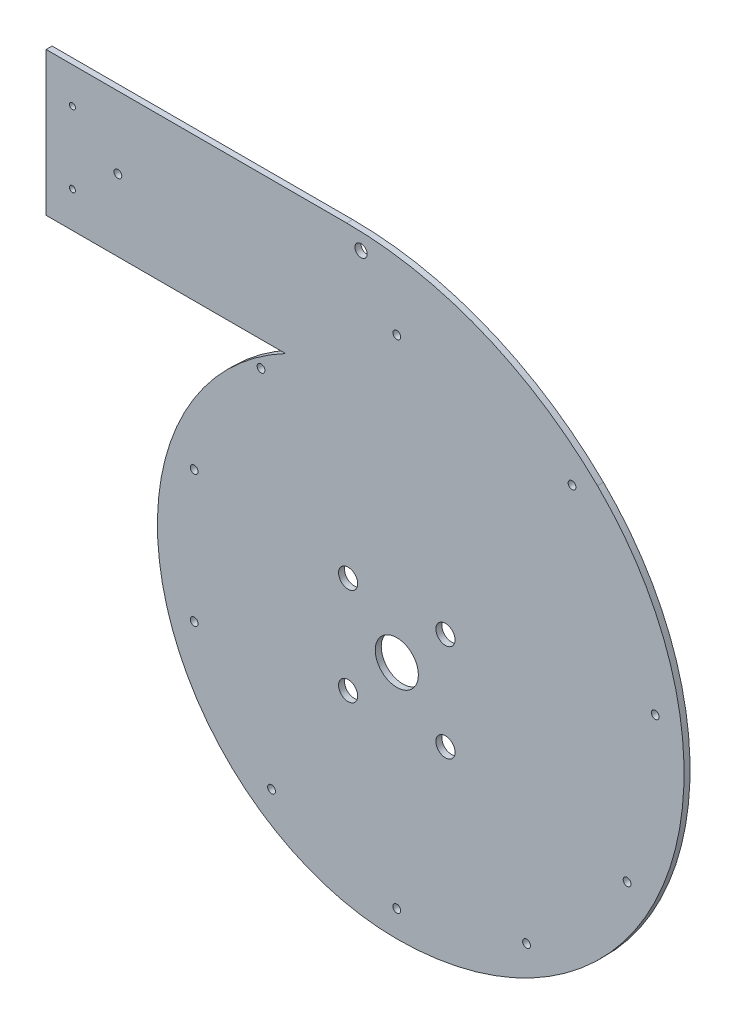
ISO-10303-21;
HEADER;
FILE_DESCRIPTION(('STEP AP214'),'2;1');
FILE_NAME('part.step','',(''),(''),'','','');
FILE_SCHEMA(('AUTOMOTIVE_DESIGN { 1 0 10303 214 1 1 1 1 }'));
ENDSEC;
DATA;
#1=APPLICATION_CONTEXT('core data for automotive mechanical design processes');
#2=APPLICATION_PROTOCOL_DEFINITION('international standard','automotive_design',2000,#1);
#3=PRODUCT_CONTEXT('',#1,'mechanical');
#4=PRODUCT('Part','Part','',(#3));
#5=PRODUCT_RELATED_PRODUCT_CATEGORY('part','',(#4));
#6=PRODUCT_DEFINITION_FORMATION('','',#4);
#7=PRODUCT_DEFINITION_CONTEXT('part definition',#1,'design');
#8=PRODUCT_DEFINITION('design','',#6,#7);
#9=PRODUCT_DEFINITION_SHAPE('','',#8);
#10=(LENGTH_UNIT() NAMED_UNIT(*) SI_UNIT(.MILLI.,.METRE.));
#11=(NAMED_UNIT(*) PLANE_ANGLE_UNIT() SI_UNIT($,.RADIAN.));
#12=(NAMED_UNIT(*) SI_UNIT($,.STERADIAN.) SOLID_ANGLE_UNIT());
#13=UNCERTAINTY_MEASURE_WITH_UNIT(LENGTH_MEASURE(1.E-05),#10,'distance_accuracy_value','');
#14=(GEOMETRIC_REPRESENTATION_CONTEXT(3) GLOBAL_UNCERTAINTY_ASSIGNED_CONTEXT((#13)) GLOBAL_UNIT_ASSIGNED_CONTEXT((#10,
#11,#12)) REPRESENTATION_CONTEXT('',''));
#15=CARTESIAN_POINT('',(0.,0.,0.));
#16=DIRECTION('',(0.,0.,1.));
#17=DIRECTION('',(1.,0.,0.));
#18=AXIS2_PLACEMENT_3D('',#15,#16,#17);
#19=CARTESIAN_POINT('',(-93.006306293609,177.058823529412,-5.));
#20=DIRECTION('',(0.,-1.,0.));
#21=DIRECTION('',(0.,0.,-1.));
#22=AXIS2_PLACEMENT_3D('',#19,#20,#21);
#23=PLANE('',#22);
#24=DIRECTION('',(1.,0.,0.));
#25=VECTOR('',#24,1.);
#26=CARTESIAN_POINT('',(-93.006306293609,177.058823529412,0.));
#27=LINE('',#26,#25);
#28=CARTESIAN_POINT('',(-293.006306293609,177.058823529412,0.));
#29=VERTEX_POINT('',#28);
#30=CARTESIAN_POINT('',(-93.006306293609,177.058823529412,0.));
#31=VERTEX_POINT('',#30);
#32=EDGE_CURVE('E130',#29,#31,#27,.T.);
#33=ORIENTED_EDGE('',*,*,#32,.F.);
#34=DIRECTION('',(0.,0.,1.));
#35=VECTOR('',#34,1.);
#36=CARTESIAN_POINT('',(-293.006306293609,177.058823529412,-5.));
#37=LINE('',#36,#35);
#38=CARTESIAN_POINT('',(-293.006306293609,177.058823529412,-5.));
#39=VERTEX_POINT('',#38);
#40=EDGE_CURVE('E46',#39,#29,#37,.T.);
#41=ORIENTED_EDGE('',*,*,#40,.F.);
#42=DIRECTION('',(1.,0.,0.));
#43=VECTOR('',#42,1.);
#44=CARTESIAN_POINT('',(-93.006306293609,177.058823529412,-5.));
#45=LINE('',#44,#43);
#46=CARTESIAN_POINT('',(-93.006306293609,177.058823529412,-5.));
#47=VERTEX_POINT('',#46);
#48=EDGE_CURVE('E109',#39,#47,#45,.T.);
#49=ORIENTED_EDGE('',*,*,#48,.T.);
#50=DIRECTION('',(0.,0.,1.));
#51=VECTOR('',#50,1.);
#52=CARTESIAN_POINT('',(-93.006306293609,177.058823529412,-5.));
#53=LINE('',#52,#51);
#54=EDGE_CURVE('E11',#47,#31,#53,.T.);
#55=ORIENTED_EDGE('',*,*,#54,.T.);
#56=EDGE_LOOP('',(#33,#41,#49,#55));
#57=FACE_BOUND('',#56,.T.);
#58=ADVANCED_FACE('F36',(#57),#23,.T.);
#59=CARTESIAN_POINT('',(-293.006306293609,297.058823529412,-5.));
#60=DIRECTION('',(-1.,0.,0.));
#61=DIRECTION('',(0.,0.,1.));
#62=AXIS2_PLACEMENT_3D('',#59,#60,#61);
#63=PLANE('',#62);
#64=DIRECTION('',(0.,-1.,0.));
#65=VECTOR('',#64,1.);
#66=CARTESIAN_POINT('',(-293.006306293609,297.058823529412,0.));
#67=LINE('',#66,#65);
#68=CARTESIAN_POINT('',(-293.006306293609,297.058823529412,0.));
#69=VERTEX_POINT('',#68);
#70=EDGE_CURVE('E95',#69,#29,#67,.T.);
#71=ORIENTED_EDGE('',*,*,#70,.F.);
#72=DIRECTION('',(0.,0.,1.));
#73=VECTOR('',#72,1.);
#74=CARTESIAN_POINT('',(-293.006306293609,297.058823529412,-5.));
#75=LINE('',#74,#73);
#76=CARTESIAN_POINT('',(-293.006306293609,297.058823529412,-5.));
#77=VERTEX_POINT('',#76);
#78=EDGE_CURVE('E90',#77,#69,#75,.T.);
#79=ORIENTED_EDGE('',*,*,#78,.F.);
#80=DIRECTION('',(0.,-1.,0.));
#81=VECTOR('',#80,1.);
#82=CARTESIAN_POINT('',(-293.006306293609,297.058823529412,-5.));
#83=LINE('',#82,#81);
#84=EDGE_CURVE('E93',#77,#39,#83,.T.);
#85=ORIENTED_EDGE('',*,*,#84,.T.);
#86=ORIENTED_EDGE('',*,*,#40,.T.);
#87=EDGE_LOOP('',(#71,#79,#85,#86));
#88=FACE_BOUND('',#87,.T.);
#89=ADVANCED_FACE('F92',(#88),#63,.T.);
#90=CARTESIAN_POINT('',(-41.905314261103,297.058823529412,-5.));
#91=DIRECTION('',(0.,1.,0.));
#92=DIRECTION('',(0.,0.,1.));
#93=AXIS2_PLACEMENT_3D('',#90,#91,#92);
#94=PLANE('',#93);
#95=DIRECTION('',(-1.,0.,0.));
#96=VECTOR('',#95,1.);
#97=CARTESIAN_POINT('',(-41.905314261103,297.058823529412,0.));
#98=LINE('',#97,#96);
#99=CARTESIAN_POINT('',(-41.905314261103,297.058823529412,0.));
#100=VERTEX_POINT('',#99);
#101=EDGE_CURVE('E127',#100,#69,#98,.T.);
#102=ORIENTED_EDGE('',*,*,#101,.F.);
#103=DIRECTION('',(0.,0.,1.));
#104=VECTOR('',#103,1.);
#105=CARTESIAN_POINT('',(-41.905314261103,297.058823529412,-5.));
#106=LINE('',#105,#104);
#107=CARTESIAN_POINT('',(-41.905314261103,297.058823529412,-5.));
#108=VERTEX_POINT('',#107);
#109=EDGE_CURVE('E100',#108,#100,#106,.T.);
#110=ORIENTED_EDGE('',*,*,#109,.F.);
#111=DIRECTION('',(-1.,0.,0.));
#112=VECTOR('',#111,1.);
#113=CARTESIAN_POINT('',(-41.905314261103,297.058823529412,-5.));
#114=LINE('',#113,#112);
#115=EDGE_CURVE('E106',#108,#77,#114,.T.);
#116=ORIENTED_EDGE('',*,*,#115,.T.);
#117=ORIENTED_EDGE('',*,*,#78,.T.);
#118=EDGE_LOOP('',(#102,#110,#116,#117));
#119=FACE_BOUND('',#118,.T.);
#120=ADVANCED_FACE('F111',(#119),#94,.T.);
#121=CARTESIAN_POINT('',(-41.905314261103,-2.94117647058825,-5.));
#122=DIRECTION('',(0.,0.,1.));
#123=DIRECTION('',(1.,0.,0.));
#124=AXIS2_PLACEMENT_3D('',#121,#122,#123);
#125=CYLINDRICAL_SURFACE('',#124,300.);
#126=CARTESIAN_POINT('',(-41.905314261103,-2.94117647058825,0.));
#127=DIRECTION('',(0.,0.,1.));
#128=DIRECTION('',(1.,0.,0.));
#129=AXIS2_PLACEMENT_3D('',#126,#127,#128);
#130=CIRCLE('',#129,300.);
#131=CARTESIAN_POINT('',(167.621257044412,211.764705882353,0.));
#132=VERTEX_POINT('',#131);
#133=EDGE_CURVE('E124',#132,#100,#130,.T.);
#134=ORIENTED_EDGE('',*,*,#133,.F.);
#135=DIRECTION('',(0.,0.,1.));
#136=VECTOR('',#135,1.);
#137=CARTESIAN_POINT('',(167.621257044412,211.764705882353,-5.));
#138=LINE('',#137,#136);
#139=CARTESIAN_POINT('',(167.621257044412,211.764705882353,-5.));
#140=VERTEX_POINT('',#139);
#141=EDGE_CURVE('E134',#140,#132,#138,.T.);
#142=ORIENTED_EDGE('',*,*,#141,.F.);
#143=CARTESIAN_POINT('',(-41.905314261103,-2.94117647058825,-5.));
#144=DIRECTION('',(0.,0.,1.));
#145=DIRECTION('',(1.,0.,0.));
#146=AXIS2_PLACEMENT_3D('',#143,#144,#145);
#147=CIRCLE('',#146,300.);
#148=EDGE_CURVE('E112',#140,#108,#147,.T.);
#149=ORIENTED_EDGE('',*,*,#148,.T.);
#150=ORIENTED_EDGE('',*,*,#109,.T.);
#151=EDGE_LOOP('',(#134,#142,#149,#150));
#152=FACE_BOUND('',#151,.T.);
#153=ADVANCED_FACE('F156',(#152),#125,.T.);
#154=CARTESIAN_POINT('',(0.,40.,-5.));
#155=DIRECTION('',(0.,0.,1.));
#156=DIRECTION('',(1.,0.,0.));
#157=AXIS2_PLACEMENT_3D('',#154,#155,#156);
#158=CYLINDRICAL_SURFACE('',#157,240.);
#159=CARTESIAN_POINT('',(0.,40.,0.));
#160=DIRECTION('',(0.,0.,1.));
#161=DIRECTION('',(1.,0.,0.));
#162=AXIS2_PLACEMENT_3D('',#159,#160,#161);
#163=CIRCLE('',#162,240.);
#164=CARTESIAN_POINT('',(0.,-200.,0.));
#165=VERTEX_POINT('',#164);
#166=EDGE_CURVE('E120',#165,#132,#163,.T.);
#167=ORIENTED_EDGE('',*,*,#166,.F.);
#168=DIRECTION('',(0.,0.,1.));
#169=VECTOR('',#168,1.);
#170=CARTESIAN_POINT('',(0.,-200.,-5.));
#171=LINE('',#170,#169);
#172=CARTESIAN_POINT('',(0.,-200.,-5.));
#173=VERTEX_POINT('',#172);
#174=EDGE_CURVE('E40',#173,#165,#171,.T.);
#175=ORIENTED_EDGE('',*,*,#174,.F.);
#176=CARTESIAN_POINT('',(0.,40.,-5.));
#177=DIRECTION('',(0.,0.,1.));
#178=DIRECTION('',(1.,0.,0.));
#179=AXIS2_PLACEMENT_3D('',#176,#177,#178);
#180=CIRCLE('',#179,240.);
#181=EDGE_CURVE('E114',#173,#140,#180,.T.);
#182=ORIENTED_EDGE('',*,*,#181,.T.);
#183=ORIENTED_EDGE('',*,*,#141,.T.);
#184=EDGE_LOOP('',(#167,#175,#182,#183));
#185=FACE_BOUND('',#184,.T.);
#186=ADVANCED_FACE('F140',(#185),#158,.T.);
#187=CARTESIAN_POINT('',(0.,0.,-5.));
#188=DIRECTION('',(0.,0.,1.));
#189=DIRECTION('',(1.,0.,0.));
#190=AXIS2_PLACEMENT_3D('',#187,#188,#189);
#191=CYLINDRICAL_SURFACE('',#190,200.);
#192=CARTESIAN_POINT('',(0.,0.,0.));
#193=DIRECTION('',(0.,0.,1.));
#194=DIRECTION('',(1.,0.,0.));
#195=AXIS2_PLACEMENT_3D('',#192,#193,#194);
#196=CIRCLE('',#195,200.);
#197=EDGE_CURVE('E79',#31,#165,#196,.T.);
#198=ORIENTED_EDGE('',*,*,#197,.F.);
#199=ORIENTED_EDGE('',*,*,#54,.F.);
#200=CARTESIAN_POINT('',(0.,0.,-5.));
#201=DIRECTION('',(0.,0.,1.));
#202=DIRECTION('',(-1.,0.,0.));
#203=AXIS2_PLACEMENT_3D('',#200,#201,#202);
#204=CIRCLE('',#203,200.);
#205=EDGE_CURVE('E82',#47,#173,#204,.T.);
#206=ORIENTED_EDGE('',*,*,#205,.T.);
#207=ORIENTED_EDGE('',*,*,#174,.T.);
#208=EDGE_LOOP('',(#198,#199,#206,#207));
#209=FACE_BOUND('',#208,.T.);
#210=ADVANCED_FACE('F38',(#209),#191,.T.);
#211=CARTESIAN_POINT('',(0.,0.,-5.));
#212=DIRECTION('',(0.,0.,-1.));
#213=DIRECTION('',(-1.,0.,0.));
#214=AXIS2_PLACEMENT_3D('',#211,#212,#213);
#215=PLANE('',#214);
#216=CARTESIAN_POINT('',(-271.006306293609,207.058823529412,-5.));
#217=DIRECTION('',(0.,0.,1.));
#218=DIRECTION('',(1.,0.,0.));
#219=AXIS2_PLACEMENT_3D('',#216,#217,#218);
#220=CIRCLE('',#219,2.50000000000002);
#221=CARTESIAN_POINT('',(-268.506306293609,207.058823529412,-5.));
#222=VERTEX_POINT('',#221);
#223=EDGE_CURVE('E253',#222,#222,#220,.T.);
#224=ORIENTED_EDGE('',*,*,#223,.T.);
#225=EDGE_LOOP('',(#224));
#226=FACE_BOUND('',#225,.T.);
#227=CARTESIAN_POINT('',(-271.006306293609,267.058823529412,-5.));
#228=DIRECTION('',(0.,0.,1.));
#229=DIRECTION('',(-1.,0.,0.));
#230=AXIS2_PLACEMENT_3D('',#227,#228,#229);
#231=CIRCLE('',#230,2.50000000000002);
#232=CARTESIAN_POINT('',(-273.506306293609,267.058823529412,-5.));
#233=VERTEX_POINT('',#232);
#234=EDGE_CURVE('E257',#233,#233,#231,.T.);
#235=ORIENTED_EDGE('',*,*,#234,.T.);
#236=EDGE_LOOP('',(#235));
#237=FACE_BOUND('',#236,.T.);
#238=CARTESIAN_POINT('',(192.393369960535,-62.5123953248023,-5.));
#239=DIRECTION('',(0.,0.,-1.));
#240=DIRECTION('',(-1.,0.,0.));
#241=AXIS2_PLACEMENT_3D('',#238,#239,#240);
#242=CIRCLE('',#241,3.25);
#243=CARTESIAN_POINT('',(189.143369960535,-62.5123953248023,-5.));
#244=VERTEX_POINT('',#243);
#245=EDGE_CURVE('E329',#244,#244,#242,.T.);
#246=ORIENTED_EDGE('',*,*,#245,.F.);
#247=EDGE_LOOP('',(#246));
#248=FACE_BOUND('',#247,.T.);
#249=CARTESIAN_POINT('',(215.904780052234,70.1517155498044,-5.));
#250=DIRECTION('',(0.,0.,-1.));
#251=DIRECTION('',(-1.,0.,0.));
#252=AXIS2_PLACEMENT_3D('',#249,#250,#251);
#253=CIRCLE('',#252,3.25000000000001);
#254=CARTESIAN_POINT('',(212.654780052234,70.1517155498044,-5.));
#255=VERTEX_POINT('',#254);
#256=EDGE_CURVE('E326',#255,#255,#253,.T.);
#257=ORIENTED_EDGE('',*,*,#256,.F.);
#258=EDGE_LOOP('',(#257));
#259=FACE_BOUND('',#258,.T.);
#260=CARTESIAN_POINT('',(146.429769795033,201.543287764639,-5.));
#261=DIRECTION('',(0.,0.,-1.));
#262=DIRECTION('',(-1.,0.,0.));
#263=AXIS2_PLACEMENT_3D('',#260,#261,#262);
#264=CIRCLE('',#263,3.25000000000001);
#265=CARTESIAN_POINT('',(143.179769795033,201.543287764639,-5.));
#266=VERTEX_POINT('',#265);
#267=EDGE_CURVE('E323',#266,#266,#264,.T.);
#268=ORIENTED_EDGE('',*,*,#267,.F.);
#269=EDGE_LOOP('',(#268));
#270=FACE_BOUND('',#269,.T.);
#271=CARTESIAN_POINT('',(-233.006306293609,237.058823529412,-5.));
#272=DIRECTION('',(0.,0.,-1.));
#273=DIRECTION('',(-1.,0.,0.));
#274=AXIS2_PLACEMENT_3D('',#271,#272,#273);
#275=CIRCLE('',#274,3.25000000000001);
#276=CARTESIAN_POINT('',(-236.256306293609,237.058823529412,-5.));
#277=VERTEX_POINT('',#276);
#278=EDGE_CURVE('E320',#277,#277,#275,.T.);
#279=ORIENTED_EDGE('',*,*,#278,.F.);
#280=EDGE_LOOP('',(#279));
#281=FACE_BOUND('',#280,.T.);
#282=CARTESIAN_POINT('',(0.,237.058823529412,-5.));
#283=DIRECTION('',(0.,0.,-1.));
#284=DIRECTION('',(-1.,0.,0.));
#285=AXIS2_PLACEMENT_3D('',#282,#283,#284);
#286=CIRCLE('',#285,3.25);
#287=CARTESIAN_POINT('',(-3.25,237.058823529412,-5.));
#288=VERTEX_POINT('',#287);
#289=EDGE_CURVE('E317',#288,#288,#286,.T.);
#290=ORIENTED_EDGE('',*,*,#289,.F.);
#291=EDGE_LOOP('',(#290));
#292=FACE_BOUND('',#291,.T.);
#293=CARTESIAN_POINT('',(-169.288059900537,55.0050249987407,-5.));
#294=DIRECTION('',(0.,0.,-1.));
#295=DIRECTION('',(-1.,0.,0.));
#296=AXIS2_PLACEMENT_3D('',#293,#294,#295);
#297=CIRCLE('',#296,3.24999999999998);
#298=CARTESIAN_POINT('',(-172.538059900537,55.0050249987407,-5.));
#299=VERTEX_POINT('',#298);
#300=EDGE_CURVE('E314',#299,#299,#297,.T.);
#301=ORIENTED_EDGE('',*,*,#300,.F.);
#302=EDGE_LOOP('',(#301));
#303=FACE_BOUND('',#302,.T.);
#304=CARTESIAN_POINT('',(0.,-178.,-5.));
#305=DIRECTION('',(0.,0.,-1.));
#306=DIRECTION('',(-1.,0.,0.));
#307=AXIS2_PLACEMENT_3D('',#304,#305,#306);
#308=CIRCLE('',#307,3.25);
#309=CARTESIAN_POINT('',(-3.25000000000005,-178.,-5.));
#310=VERTEX_POINT('',#309);
#311=EDGE_CURVE('E311',#310,#310,#308,.T.);
#312=ORIENTED_EDGE('',*,*,#311,.F.);
#313=EDGE_LOOP('',(#312));
#314=FACE_BOUND('',#313,.T.);
#315=CARTESIAN_POINT('',(-104.62577490806,-144.005024998741,-5.));
#316=DIRECTION('',(0.,0.,-1.));
#317=DIRECTION('',(-1.,0.,0.));
#318=AXIS2_PLACEMENT_3D('',#315,#316,#317);
#319=CIRCLE('',#318,3.25000000000008);
#320=CARTESIAN_POINT('',(-107.87577490806,-144.005024998741,-5.));
#321=VERTEX_POINT('',#320);
#322=EDGE_CURVE('E308',#321,#321,#319,.T.);
#323=ORIENTED_EDGE('',*,*,#322,.F.);
#324=EDGE_LOOP('',(#323));
#325=FACE_BOUND('',#324,.T.);
#326=CARTESIAN_POINT('',(108.368646242067,-149.156645433518,-5.));
#327=DIRECTION('',(0.,0.,-1.));
#328=DIRECTION('',(-1.,0.,0.));
#329=AXIS2_PLACEMENT_3D('',#326,#327,#328);
#330=CIRCLE('',#329,3.25000000000001);
#331=CARTESIAN_POINT('',(105.118646242067,-149.156645433518,-5.));
#332=VERTEX_POINT('',#331);
#333=EDGE_CURVE('E305',#332,#332,#330,.T.);
#334=ORIENTED_EDGE('',*,*,#333,.F.);
#335=EDGE_LOOP('',(#334));
#336=FACE_BOUND('',#335,.T.);
#337=CARTESIAN_POINT('',(-113.442553692447,156.140279914365,-5.));
#338=DIRECTION('',(0.,0.,-1.));
#339=DIRECTION('',(-1.,0.,0.));
#340=AXIS2_PLACEMENT_3D('',#337,#338,#339);
#341=CIRCLE('',#340,3.25000000000001);
#342=CARTESIAN_POINT('',(-116.692553692447,156.140279914365,-5.));
#343=VERTEX_POINT('',#342);
#344=EDGE_CURVE('E302',#343,#343,#341,.T.);
#345=ORIENTED_EDGE('',*,*,#344,.F.);
#346=EDGE_LOOP('',(#345));
#347=FACE_BOUND('',#346,.T.);
#348=CARTESIAN_POINT('',(-169.288059900537,-55.0050249987406,-5.));
#349=DIRECTION('',(0.,0.,-1.));
#350=DIRECTION('',(-1.,0.,0.));
#351=AXIS2_PLACEMENT_3D('',#348,#349,#350);
#352=CIRCLE('',#351,3.25000000000002);
#353=CARTESIAN_POINT('',(-172.538059900537,-55.0050249987406,-5.));
#354=VERTEX_POINT('',#353);
#355=EDGE_CURVE('E299',#354,#354,#352,.T.);
#356=ORIENTED_EDGE('',*,*,#355,.F.);
#357=EDGE_LOOP('',(#356));
#358=FACE_BOUND('',#357,.T.);
#359=CARTESIAN_POINT('',(-29.905314261103,283.058823529412,-5.));
#360=DIRECTION('',(0.,0.,1.));
#361=DIRECTION('',(1.,0.,0.));
#362=AXIS2_PLACEMENT_3D('',#359,#360,#361);
#363=CIRCLE('',#362,5.1);
#364=CARTESIAN_POINT('',(-24.805314261103,283.058823529412,-5.));
#365=VERTEX_POINT('',#364);
#366=EDGE_CURVE('E333',#365,#365,#363,.T.);
#367=ORIENTED_EDGE('',*,*,#366,.T.);
#368=EDGE_LOOP('',(#367));
#369=FACE_BOUND('',#368,.T.);
#370=CARTESIAN_POINT('',(40.6586399182264,40.6586399182266,-5.));
#371=DIRECTION('',(0.,0.,-1.));
#372=DIRECTION('',(-1.,0.,0.));
#373=AXIS2_PLACEMENT_3D('',#370,#371,#372);
#374=CIRCLE('',#373,8.);
#375=CARTESIAN_POINT('',(32.6586399182264,40.6586399182266,-5.));
#376=VERTEX_POINT('',#375);
#377=EDGE_CURVE('E341',#376,#376,#374,.T.);
#378=ORIENTED_EDGE('',*,*,#377,.F.);
#379=EDGE_LOOP('',(#378));
#380=FACE_BOUND('',#379,.T.);
#381=CARTESIAN_POINT('',(-40.6586399182266,40.6586399182264,-5.));
#382=DIRECTION('',(0.,0.,-1.));
#383=DIRECTION('',(-1.,0.,0.));
#384=AXIS2_PLACEMENT_3D('',#381,#382,#383);
#385=CIRCLE('',#384,8.);
#386=CARTESIAN_POINT('',(-48.6586399182266,40.6586399182264,-5.));
#387=VERTEX_POINT('',#386);
#388=EDGE_CURVE('E347',#387,#387,#385,.T.);
#389=ORIENTED_EDGE('',*,*,#388,.F.);
#390=EDGE_LOOP('',(#389));
#391=FACE_BOUND('',#390,.T.);
#392=CARTESIAN_POINT('',(-40.6586399182264,-40.6586399182266,-5.));
#393=DIRECTION('',(0.,0.,-1.));
#394=DIRECTION('',(-1.,0.,0.));
#395=AXIS2_PLACEMENT_3D('',#392,#393,#394);
#396=CIRCLE('',#395,8.);
#397=CARTESIAN_POINT('',(-48.6586399182264,-40.6586399182266,-5.));
#398=VERTEX_POINT('',#397);
#399=EDGE_CURVE('E353',#398,#398,#396,.T.);
#400=ORIENTED_EDGE('',*,*,#399,.F.);
#401=EDGE_LOOP('',(#400));
#402=FACE_BOUND('',#401,.T.);
#403=CARTESIAN_POINT('',(40.6586399182266,-40.6586399182264,-5.));
#404=DIRECTION('',(0.,0.,-1.));
#405=DIRECTION('',(-1.,0.,0.));
#406=AXIS2_PLACEMENT_3D('',#403,#404,#405);
#407=CIRCLE('',#406,8.);
#408=CARTESIAN_POINT('',(32.6586399182266,-40.6586399182264,-5.));
#409=VERTEX_POINT('',#408);
#410=EDGE_CURVE('E359',#409,#409,#407,.T.);
#411=ORIENTED_EDGE('',*,*,#410,.F.);
#412=EDGE_LOOP('',(#411));
#413=FACE_BOUND('',#412,.T.);
#414=CARTESIAN_POINT('',(0.,0.,-5.));
#415=DIRECTION('',(0.,0.,-1.));
#416=DIRECTION('',(-1.,0.,0.));
#417=AXIS2_PLACEMENT_3D('',#414,#415,#416);
#418=CIRCLE('',#417,18.);
#419=CARTESIAN_POINT('',(-18.,0.,-5.));
#420=VERTEX_POINT('',#419);
#421=EDGE_CURVE('E121',#420,#420,#418,.T.);
#422=ORIENTED_EDGE('',*,*,#421,.F.);
#423=EDGE_LOOP('',(#422));
#424=FACE_BOUND('',#423,.T.);
#425=ORIENTED_EDGE('',*,*,#205,.F.);
#426=ORIENTED_EDGE('',*,*,#48,.F.);
#427=ORIENTED_EDGE('',*,*,#84,.F.);
#428=ORIENTED_EDGE('',*,*,#115,.F.);
#429=ORIENTED_EDGE('',*,*,#148,.F.);
#430=ORIENTED_EDGE('',*,*,#181,.F.);
#431=EDGE_LOOP('',(#425,#426,#427,#428,#429,#430));
#432=FACE_BOUND('',#431,.T.);
#433=ADVANCED_FACE('F104',(#226,#237,#248,#259,#270,#281,#292,#303,#314,#325,#336,#347,#358,
#369,#380,#391,#402,#413,#424,#432),#215,.T.);
#434=CARTESIAN_POINT('',(0.,0.,0.));
#435=DIRECTION('',(0.,0.,-1.));
#436=DIRECTION('',(-1.,0.,0.));
#437=AXIS2_PLACEMENT_3D('',#434,#435,#436);
#438=PLANE('',#437);
#439=CARTESIAN_POINT('',(-271.006306293609,207.058823529412,0.));
#440=DIRECTION('',(0.,0.,1.));
#441=DIRECTION('',(1.,0.,0.));
#442=AXIS2_PLACEMENT_3D('',#439,#440,#441);
#443=CIRCLE('',#442,2.50000000000002);
#444=CARTESIAN_POINT('',(-268.506306293609,207.058823529412,0.));
#445=VERTEX_POINT('',#444);
#446=EDGE_CURVE('E256',#445,#445,#443,.T.);
#447=ORIENTED_EDGE('',*,*,#446,.F.);
#448=EDGE_LOOP('',(#447));
#449=FACE_BOUND('',#448,.T.);
#450=CARTESIAN_POINT('',(-271.006306293609,267.058823529412,0.));
#451=DIRECTION('',(0.,0.,1.));
#452=DIRECTION('',(-1.,0.,0.));
#453=AXIS2_PLACEMENT_3D('',#450,#451,#452);
#454=CIRCLE('',#453,2.50000000000002);
#455=CARTESIAN_POINT('',(-273.506306293609,267.058823529412,0.));
#456=VERTEX_POINT('',#455);
#457=EDGE_CURVE('E262',#456,#456,#454,.T.);
#458=ORIENTED_EDGE('',*,*,#457,.F.);
#459=EDGE_LOOP('',(#458));
#460=FACE_BOUND('',#459,.T.);
#461=CARTESIAN_POINT('',(192.393369960535,-62.5123953248023,0.));
#462=DIRECTION('',(0.,0.,1.));
#463=DIRECTION('',(1.,0.,0.));
#464=AXIS2_PLACEMENT_3D('',#461,#462,#463);
#465=CIRCLE('',#464,3.25);
#466=CARTESIAN_POINT('',(195.643369960535,-62.5123953248023,0.));
#467=VERTEX_POINT('',#466);
#468=EDGE_CURVE('E270',#467,#467,#465,.T.);
#469=ORIENTED_EDGE('',*,*,#468,.F.);
#470=EDGE_LOOP('',(#469));
#471=FACE_BOUND('',#470,.T.);
#472=CARTESIAN_POINT('',(215.904780052234,70.1517155498044,0.));
#473=DIRECTION('',(0.,0.,1.));
#474=DIRECTION('',(1.,0.,0.));
#475=AXIS2_PLACEMENT_3D('',#472,#473,#474);
#476=CIRCLE('',#475,3.25000000000001);
#477=CARTESIAN_POINT('',(219.154780052234,70.1517155498044,0.));
#478=VERTEX_POINT('',#477);
#479=EDGE_CURVE('E280',#478,#478,#476,.T.);
#480=ORIENTED_EDGE('',*,*,#479,.F.);
#481=EDGE_LOOP('',(#480));
#482=FACE_BOUND('',#481,.T.);
#483=CARTESIAN_POINT('',(146.429769795033,201.543287764639,0.));
#484=DIRECTION('',(0.,0.,1.));
#485=DIRECTION('',(1.,0.,0.));
#486=AXIS2_PLACEMENT_3D('',#483,#484,#485);
#487=CIRCLE('',#486,3.25000000000001);
#488=CARTESIAN_POINT('',(149.679769795033,201.543287764639,0.));
#489=VERTEX_POINT('',#488);
#490=EDGE_CURVE('E277',#489,#489,#487,.T.);
#491=ORIENTED_EDGE('',*,*,#490,.F.);
#492=EDGE_LOOP('',(#491));
#493=FACE_BOUND('',#492,.T.);
#494=CARTESIAN_POINT('',(-233.006306293609,237.058823529412,0.));
#495=DIRECTION('',(0.,0.,1.));
#496=DIRECTION('',(1.,0.,0.));
#497=AXIS2_PLACEMENT_3D('',#494,#495,#496);
#498=CIRCLE('',#497,3.25000000000001);
#499=CARTESIAN_POINT('',(-229.756306293609,237.058823529412,0.));
#500=VERTEX_POINT('',#499);
#501=EDGE_CURVE('E273',#500,#500,#498,.T.);
#502=ORIENTED_EDGE('',*,*,#501,.F.);
#503=EDGE_LOOP('',(#502));
#504=FACE_BOUND('',#503,.T.);
#505=CARTESIAN_POINT('',(0.,237.058823529412,0.));
#506=DIRECTION('',(0.,0.,1.));
#507=DIRECTION('',(1.,0.,0.));
#508=AXIS2_PLACEMENT_3D('',#505,#506,#507);
#509=CIRCLE('',#508,3.25);
#510=CARTESIAN_POINT('',(3.25,237.058823529412,0.));
#511=VERTEX_POINT('',#510);
#512=EDGE_CURVE('E276',#511,#511,#509,.T.);
#513=ORIENTED_EDGE('',*,*,#512,.F.);
#514=EDGE_LOOP('',(#513));
#515=FACE_BOUND('',#514,.T.);
#516=CARTESIAN_POINT('',(-169.288059900537,55.0050249987407,0.));
#517=DIRECTION('',(0.,0.,1.));
#518=DIRECTION('',(1.,0.,0.));
#519=AXIS2_PLACEMENT_3D('',#516,#517,#518);
#520=CIRCLE('',#519,3.24999999999998);
#521=CARTESIAN_POINT('',(-166.038059900537,55.0050249987407,0.));
#522=VERTEX_POINT('',#521);
#523=EDGE_CURVE('E292',#522,#522,#520,.T.);
#524=ORIENTED_EDGE('',*,*,#523,.F.);
#525=EDGE_LOOP('',(#524));
#526=FACE_BOUND('',#525,.T.);
#527=CARTESIAN_POINT('',(0.,-178.,0.));
#528=DIRECTION('',(0.,0.,1.));
#529=DIRECTION('',(1.,0.,0.));
#530=AXIS2_PLACEMENT_3D('',#527,#528,#529);
#531=CIRCLE('',#530,3.25);
#532=CARTESIAN_POINT('',(3.24999999999996,-178.,0.));
#533=VERTEX_POINT('',#532);
#534=EDGE_CURVE('E289',#533,#533,#531,.T.);
#535=ORIENTED_EDGE('',*,*,#534,.F.);
#536=EDGE_LOOP('',(#535));
#537=FACE_BOUND('',#536,.T.);
#538=CARTESIAN_POINT('',(-104.62577490806,-144.005024998741,0.));
#539=DIRECTION('',(0.,0.,1.));
#540=DIRECTION('',(1.,0.,0.));
#541=AXIS2_PLACEMENT_3D('',#538,#539,#540);
#542=CIRCLE('',#541,3.25000000000008);
#543=CARTESIAN_POINT('',(-101.37577490806,-144.005024998741,0.));
#544=VERTEX_POINT('',#543);
#545=EDGE_CURVE('E285',#544,#544,#542,.T.);
#546=ORIENTED_EDGE('',*,*,#545,.F.);
#547=EDGE_LOOP('',(#546));
#548=FACE_BOUND('',#547,.T.);
#549=CARTESIAN_POINT('',(108.368646242067,-149.156645433518,0.));
#550=DIRECTION('',(0.,0.,1.));
#551=DIRECTION('',(1.,0.,0.));
#552=AXIS2_PLACEMENT_3D('',#549,#550,#551);
#553=CIRCLE('',#552,3.25000000000001);
#554=CARTESIAN_POINT('',(111.618646242067,-149.156645433518,0.));
#555=VERTEX_POINT('',#554);
#556=EDGE_CURVE('E267',#555,#555,#553,.T.);
#557=ORIENTED_EDGE('',*,*,#556,.F.);
#558=EDGE_LOOP('',(#557));
#559=FACE_BOUND('',#558,.T.);
#560=CARTESIAN_POINT('',(-113.442553692447,156.140279914365,0.));
#561=DIRECTION('',(0.,0.,1.));
#562=DIRECTION('',(1.,0.,0.));
#563=AXIS2_PLACEMENT_3D('',#560,#561,#562);
#564=CIRCLE('',#563,3.25000000000001);
#565=CARTESIAN_POINT('',(-110.192553692447,156.140279914365,0.));
#566=VERTEX_POINT('',#565);
#567=EDGE_CURVE('E259',#566,#566,#564,.T.);
#568=ORIENTED_EDGE('',*,*,#567,.F.);
#569=EDGE_LOOP('',(#568));
#570=FACE_BOUND('',#569,.T.);
#571=CARTESIAN_POINT('',(-169.288059900537,-55.0050249987406,0.));
#572=DIRECTION('',(0.,0.,1.));
#573=DIRECTION('',(1.,0.,0.));
#574=AXIS2_PLACEMENT_3D('',#571,#572,#573);
#575=CIRCLE('',#574,3.25000000000002);
#576=CARTESIAN_POINT('',(-166.038059900537,-55.0050249987406,0.));
#577=VERTEX_POINT('',#576);
#578=EDGE_CURVE('E288',#577,#577,#575,.T.);
#579=ORIENTED_EDGE('',*,*,#578,.F.);
#580=EDGE_LOOP('',(#579));
#581=FACE_BOUND('',#580,.T.);
#582=CARTESIAN_POINT('',(-29.905314261103,283.058823529412,0.));
#583=DIRECTION('',(0.,0.,1.));
#584=DIRECTION('',(1.,0.,0.));
#585=AXIS2_PLACEMENT_3D('',#582,#583,#584);
#586=CIRCLE('',#585,5.1);
#587=CARTESIAN_POINT('',(-24.805314261103,283.058823529412,0.));
#588=VERTEX_POINT('',#587);
#589=EDGE_CURVE('E332',#588,#588,#586,.T.);
#590=ORIENTED_EDGE('',*,*,#589,.F.);
#591=EDGE_LOOP('',(#590));
#592=FACE_BOUND('',#591,.T.);
#593=CARTESIAN_POINT('',(40.6586399182264,40.6586399182266,0.));
#594=DIRECTION('',(0.,0.,1.));
#595=DIRECTION('',(1.,0.,0.));
#596=AXIS2_PLACEMENT_3D('',#593,#594,#595);
#597=CIRCLE('',#596,8.);
#598=CARTESIAN_POINT('',(48.6586399182264,40.6586399182266,0.));
#599=VERTEX_POINT('',#598);
#600=EDGE_CURVE('E336',#599,#599,#597,.T.);
#601=ORIENTED_EDGE('',*,*,#600,.F.);
#602=EDGE_LOOP('',(#601));
#603=FACE_BOUND('',#602,.T.);
#604=CARTESIAN_POINT('',(-40.6586399182266,40.6586399182264,0.));
#605=DIRECTION('',(0.,0.,1.));
#606=DIRECTION('',(1.,0.,0.));
#607=AXIS2_PLACEMENT_3D('',#604,#605,#606);
#608=CIRCLE('',#607,8.);
#609=CARTESIAN_POINT('',(-32.6586399182266,40.6586399182264,0.));
#610=VERTEX_POINT('',#609);
#611=EDGE_CURVE('E344',#610,#610,#608,.T.);
#612=ORIENTED_EDGE('',*,*,#611,.F.);
#613=EDGE_LOOP('',(#612));
#614=FACE_BOUND('',#613,.T.);
#615=CARTESIAN_POINT('',(-40.6586399182264,-40.6586399182266,0.));
#616=DIRECTION('',(0.,0.,1.));
#617=DIRECTION('',(1.,0.,0.));
#618=AXIS2_PLACEMENT_3D('',#615,#616,#617);
#619=CIRCLE('',#618,8.);
#620=CARTESIAN_POINT('',(-32.6586399182264,-40.6586399182266,0.));
#621=VERTEX_POINT('',#620);
#622=EDGE_CURVE('E350',#621,#621,#619,.T.);
#623=ORIENTED_EDGE('',*,*,#622,.F.);
#624=EDGE_LOOP('',(#623));
#625=FACE_BOUND('',#624,.T.);
#626=CARTESIAN_POINT('',(40.6586399182266,-40.6586399182264,0.));
#627=DIRECTION('',(0.,0.,1.));
#628=DIRECTION('',(1.,0.,0.));
#629=AXIS2_PLACEMENT_3D('',#626,#627,#628);
#630=CIRCLE('',#629,8.);
#631=CARTESIAN_POINT('',(48.6586399182266,-40.6586399182264,0.));
#632=VERTEX_POINT('',#631);
#633=EDGE_CURVE('E356',#632,#632,#630,.T.);
#634=ORIENTED_EDGE('',*,*,#633,.F.);
#635=EDGE_LOOP('',(#634));
#636=FACE_BOUND('',#635,.T.);
#637=CARTESIAN_POINT('',(0.,0.,0.));
#638=DIRECTION('',(0.,0.,1.));
#639=DIRECTION('',(1.,0.,0.));
#640=AXIS2_PLACEMENT_3D('',#637,#638,#639);
#641=CIRCLE('',#640,18.);
#642=CARTESIAN_POINT('',(18.,0.,0.));
#643=VERTEX_POINT('',#642);
#644=EDGE_CURVE('E362',#643,#643,#641,.T.);
#645=ORIENTED_EDGE('',*,*,#644,.F.);
#646=EDGE_LOOP('',(#645));
#647=FACE_BOUND('',#646,.T.);
#648=ORIENTED_EDGE('',*,*,#32,.T.);
#649=ORIENTED_EDGE('',*,*,#197,.T.);
#650=ORIENTED_EDGE('',*,*,#166,.T.);
#651=ORIENTED_EDGE('',*,*,#133,.T.);
#652=ORIENTED_EDGE('',*,*,#101,.T.);
#653=ORIENTED_EDGE('',*,*,#70,.T.);
#654=EDGE_LOOP('',(#648,#649,#650,#651,#652,#653));
#655=FACE_BOUND('',#654,.T.);
#656=ADVANCED_FACE('F142',(#449,#460,#471,#482,#493,#504,#515,#526,#537,#548,#559,#570,#581,
#592,#603,#614,#625,#636,#647,#655),#438,.F.);
#657=CARTESIAN_POINT('',(0.,0.,-10.));
#658=DIRECTION('',(0.,0.,1.));
#659=DIRECTION('',(1.,0.,0.));
#660=AXIS2_PLACEMENT_3D('',#657,#658,#659);
#661=CYLINDRICAL_SURFACE('',#660,18.);
#662=ORIENTED_EDGE('',*,*,#421,.T.);
#663=EDGE_LOOP('',(#662));
#664=FACE_BOUND('',#663,.T.);
#665=ORIENTED_EDGE('',*,*,#644,.T.);
#666=EDGE_LOOP('',(#665));
#667=FACE_BOUND('',#666,.T.);
#668=ADVANCED_FACE('F170',(#664,#667),#661,.F.);
#669=CARTESIAN_POINT('',(40.6586399182266,-40.6586399182264,-10.));
#670=DIRECTION('',(0.,0.,1.));
#671=DIRECTION('',(1.,0.,0.));
#672=AXIS2_PLACEMENT_3D('',#669,#670,#671);
#673=CYLINDRICAL_SURFACE('',#672,8.);
#674=ORIENTED_EDGE('',*,*,#410,.T.);
#675=EDGE_LOOP('',(#674));
#676=FACE_BOUND('',#675,.T.);
#677=ORIENTED_EDGE('',*,*,#633,.T.);
#678=EDGE_LOOP('',(#677));
#679=FACE_BOUND('',#678,.T.);
#680=ADVANCED_FACE('F177',(#676,#679),#673,.F.);
#681=CARTESIAN_POINT('',(-40.6586399182264,-40.6586399182266,-10.));
#682=DIRECTION('',(0.,0.,1.));
#683=DIRECTION('',(1.,0.,0.));
#684=AXIS2_PLACEMENT_3D('',#681,#682,#683);
#685=CYLINDRICAL_SURFACE('',#684,8.);
#686=ORIENTED_EDGE('',*,*,#399,.T.);
#687=EDGE_LOOP('',(#686));
#688=FACE_BOUND('',#687,.T.);
#689=ORIENTED_EDGE('',*,*,#622,.T.);
#690=EDGE_LOOP('',(#689));
#691=FACE_BOUND('',#690,.T.);
#692=ADVANCED_FACE('F181',(#688,#691),#685,.F.);
#693=CARTESIAN_POINT('',(-40.6586399182266,40.6586399182264,-10.));
#694=DIRECTION('',(0.,0.,1.));
#695=DIRECTION('',(1.,0.,0.));
#696=AXIS2_PLACEMENT_3D('',#693,#694,#695);
#697=CYLINDRICAL_SURFACE('',#696,8.);
#698=ORIENTED_EDGE('',*,*,#388,.T.);
#699=EDGE_LOOP('',(#698));
#700=FACE_BOUND('',#699,.T.);
#701=ORIENTED_EDGE('',*,*,#611,.T.);
#702=EDGE_LOOP('',(#701));
#703=FACE_BOUND('',#702,.T.);
#704=ADVANCED_FACE('F185',(#700,#703),#697,.F.);
#705=CARTESIAN_POINT('',(40.6586399182264,40.6586399182266,-10.));
#706=DIRECTION('',(0.,0.,1.));
#707=DIRECTION('',(1.,0.,0.));
#708=AXIS2_PLACEMENT_3D('',#705,#706,#707);
#709=CYLINDRICAL_SURFACE('',#708,8.);
#710=ORIENTED_EDGE('',*,*,#377,.T.);
#711=EDGE_LOOP('',(#710));
#712=FACE_BOUND('',#711,.T.);
#713=ORIENTED_EDGE('',*,*,#600,.T.);
#714=EDGE_LOOP('',(#713));
#715=FACE_BOUND('',#714,.T.);
#716=ADVANCED_FACE('F189',(#712,#715),#709,.F.);
#717=CARTESIAN_POINT('',(-29.905314261103,283.058823529412,-5.));
#718=DIRECTION('',(0.,0.,1.));
#719=DIRECTION('',(1.,0.,0.));
#720=AXIS2_PLACEMENT_3D('',#717,#718,#719);
#721=CYLINDRICAL_SURFACE('',#720,5.1);
#722=ORIENTED_EDGE('',*,*,#366,.F.);
#723=EDGE_LOOP('',(#722));
#724=FACE_BOUND('',#723,.T.);
#725=ORIENTED_EDGE('',*,*,#589,.T.);
#726=EDGE_LOOP('',(#725));
#727=FACE_BOUND('',#726,.T.);
#728=ADVANCED_FACE('F193',(#724,#727),#721,.F.);
#729=CARTESIAN_POINT('',(-169.288059900537,-55.0050249987406,-10.));
#730=DIRECTION('',(0.,0.,1.));
#731=DIRECTION('',(1.,0.,0.));
#732=AXIS2_PLACEMENT_3D('',#729,#730,#731);
#733=CYLINDRICAL_SURFACE('',#732,3.25000000000002);
#734=ORIENTED_EDGE('',*,*,#355,.T.);
#735=EDGE_LOOP('',(#734));
#736=FACE_BOUND('',#735,.T.);
#737=ORIENTED_EDGE('',*,*,#578,.T.);
#738=EDGE_LOOP('',(#737));
#739=FACE_BOUND('',#738,.T.);
#740=ADVANCED_FACE('F197',(#736,#739),#733,.F.);
#741=CARTESIAN_POINT('',(-113.442553692447,156.140279914365,-10.));
#742=DIRECTION('',(0.,0.,1.));
#743=DIRECTION('',(1.,0.,0.));
#744=AXIS2_PLACEMENT_3D('',#741,#742,#743);
#745=CYLINDRICAL_SURFACE('',#744,3.25000000000001);
#746=ORIENTED_EDGE('',*,*,#344,.T.);
#747=EDGE_LOOP('',(#746));
#748=FACE_BOUND('',#747,.T.);
#749=ORIENTED_EDGE('',*,*,#567,.T.);
#750=EDGE_LOOP('',(#749));
#751=FACE_BOUND('',#750,.T.);
#752=ADVANCED_FACE('F201',(#748,#751),#745,.F.);
#753=CARTESIAN_POINT('',(108.368646242067,-149.156645433518,-10.));
#754=DIRECTION('',(0.,0.,1.));
#755=DIRECTION('',(1.,0.,0.));
#756=AXIS2_PLACEMENT_3D('',#753,#754,#755);
#757=CYLINDRICAL_SURFACE('',#756,3.25000000000001);
#758=ORIENTED_EDGE('',*,*,#333,.T.);
#759=EDGE_LOOP('',(#758));
#760=FACE_BOUND('',#759,.T.);
#761=ORIENTED_EDGE('',*,*,#556,.T.);
#762=EDGE_LOOP('',(#761));
#763=FACE_BOUND('',#762,.T.);
#764=ADVANCED_FACE('F219',(#760,#763),#757,.F.);
#765=CARTESIAN_POINT('',(-104.62577490806,-144.005024998741,-10.));
#766=DIRECTION('',(0.,0.,1.));
#767=DIRECTION('',(1.,0.,0.));
#768=AXIS2_PLACEMENT_3D('',#765,#766,#767);
#769=CYLINDRICAL_SURFACE('',#768,3.25000000000008);
#770=ORIENTED_EDGE('',*,*,#322,.T.);
#771=EDGE_LOOP('',(#770));
#772=FACE_BOUND('',#771,.T.);
#773=ORIENTED_EDGE('',*,*,#545,.T.);
#774=EDGE_LOOP('',(#773));
#775=FACE_BOUND('',#774,.T.);
#776=ADVANCED_FACE('F215',(#772,#775),#769,.F.);
#777=CARTESIAN_POINT('',(0.,-178.,-10.));
#778=DIRECTION('',(0.,0.,1.));
#779=DIRECTION('',(1.,0.,0.));
#780=AXIS2_PLACEMENT_3D('',#777,#778,#779);
#781=CYLINDRICAL_SURFACE('',#780,3.25);
#782=ORIENTED_EDGE('',*,*,#311,.T.);
#783=EDGE_LOOP('',(#782));
#784=FACE_BOUND('',#783,.T.);
#785=ORIENTED_EDGE('',*,*,#534,.T.);
#786=EDGE_LOOP('',(#785));
#787=FACE_BOUND('',#786,.T.);
#788=ADVANCED_FACE('F211',(#784,#787),#781,.F.);
#789=CARTESIAN_POINT('',(-169.288059900537,55.0050249987407,-10.));
#790=DIRECTION('',(0.,0.,1.));
#791=DIRECTION('',(1.,0.,0.));
#792=AXIS2_PLACEMENT_3D('',#789,#790,#791);
#793=CYLINDRICAL_SURFACE('',#792,3.24999999999998);
#794=ORIENTED_EDGE('',*,*,#300,.T.);
#795=EDGE_LOOP('',(#794));
#796=FACE_BOUND('',#795,.T.);
#797=ORIENTED_EDGE('',*,*,#523,.T.);
#798=EDGE_LOOP('',(#797));
#799=FACE_BOUND('',#798,.T.);
#800=ADVANCED_FACE('F207',(#796,#799),#793,.F.);
#801=CARTESIAN_POINT('',(0.,237.058823529412,-10.));
#802=DIRECTION('',(0.,0.,1.));
#803=DIRECTION('',(1.,0.,0.));
#804=AXIS2_PLACEMENT_3D('',#801,#802,#803);
#805=CYLINDRICAL_SURFACE('',#804,3.25);
#806=ORIENTED_EDGE('',*,*,#289,.T.);
#807=EDGE_LOOP('',(#806));
#808=FACE_BOUND('',#807,.T.);
#809=ORIENTED_EDGE('',*,*,#512,.T.);
#810=EDGE_LOOP('',(#809));
#811=FACE_BOUND('',#810,.T.);
#812=ADVANCED_FACE('F203',(#808,#811),#805,.F.);
#813=CARTESIAN_POINT('',(-233.006306293609,237.058823529412,-10.));
#814=DIRECTION('',(0.,0.,1.));
#815=DIRECTION('',(1.,0.,0.));
#816=AXIS2_PLACEMENT_3D('',#813,#814,#815);
#817=CYLINDRICAL_SURFACE('',#816,3.25000000000001);
#818=ORIENTED_EDGE('',*,*,#278,.T.);
#819=EDGE_LOOP('',(#818));
#820=FACE_BOUND('',#819,.T.);
#821=ORIENTED_EDGE('',*,*,#501,.T.);
#822=EDGE_LOOP('',(#821));
#823=FACE_BOUND('',#822,.T.);
#824=ADVANCED_FACE('F206',(#820,#823),#817,.F.);
#825=CARTESIAN_POINT('',(146.429769795033,201.543287764639,-10.));
#826=DIRECTION('',(0.,0.,1.));
#827=DIRECTION('',(1.,0.,0.));
#828=AXIS2_PLACEMENT_3D('',#825,#826,#827);
#829=CYLINDRICAL_SURFACE('',#828,3.25000000000001);
#830=ORIENTED_EDGE('',*,*,#267,.T.);
#831=EDGE_LOOP('',(#830));
#832=FACE_BOUND('',#831,.T.);
#833=ORIENTED_EDGE('',*,*,#490,.T.);
#834=EDGE_LOOP('',(#833));
#835=FACE_BOUND('',#834,.T.);
#836=ADVANCED_FACE('F229',(#832,#835),#829,.F.);
#837=CARTESIAN_POINT('',(215.904780052234,70.1517155498044,-10.));
#838=DIRECTION('',(0.,0.,1.));
#839=DIRECTION('',(1.,0.,0.));
#840=AXIS2_PLACEMENT_3D('',#837,#838,#839);
#841=CYLINDRICAL_SURFACE('',#840,3.25000000000001);
#842=ORIENTED_EDGE('',*,*,#256,.T.);
#843=EDGE_LOOP('',(#842));
#844=FACE_BOUND('',#843,.T.);
#845=ORIENTED_EDGE('',*,*,#479,.T.);
#846=EDGE_LOOP('',(#845));
#847=FACE_BOUND('',#846,.T.);
#848=ADVANCED_FACE('F225',(#844,#847),#841,.F.);
#849=CARTESIAN_POINT('',(192.393369960535,-62.5123953248023,-10.));
#850=DIRECTION('',(0.,0.,1.));
#851=DIRECTION('',(1.,0.,0.));
#852=AXIS2_PLACEMENT_3D('',#849,#850,#851);
#853=CYLINDRICAL_SURFACE('',#852,3.25);
#854=ORIENTED_EDGE('',*,*,#245,.T.);
#855=EDGE_LOOP('',(#854));
#856=FACE_BOUND('',#855,.T.);
#857=ORIENTED_EDGE('',*,*,#468,.T.);
#858=EDGE_LOOP('',(#857));
#859=FACE_BOUND('',#858,.T.);
#860=ADVANCED_FACE('F221',(#856,#859),#853,.F.);
#861=CARTESIAN_POINT('',(-271.006306293609,267.058823529412,-5.));
#862=DIRECTION('',(0.,0.,1.));
#863=DIRECTION('',(1.,0.,0.));
#864=AXIS2_PLACEMENT_3D('',#861,#862,#863);
#865=CYLINDRICAL_SURFACE('',#864,2.50000000000002);
#866=ORIENTED_EDGE('',*,*,#234,.F.);
#867=EDGE_LOOP('',(#866));
#868=FACE_BOUND('',#867,.T.);
#869=ORIENTED_EDGE('',*,*,#457,.T.);
#870=EDGE_LOOP('',(#869));
#871=FACE_BOUND('',#870,.T.);
#872=ADVANCED_FACE('F224',(#868,#871),#865,.F.);
#873=CARTESIAN_POINT('',(-271.006306293609,207.058823529412,-5.));
#874=DIRECTION('',(0.,0.,1.));
#875=DIRECTION('',(1.,0.,0.));
#876=AXIS2_PLACEMENT_3D('',#873,#874,#875);
#877=CYLINDRICAL_SURFACE('',#876,2.50000000000002);
#878=ORIENTED_EDGE('',*,*,#223,.F.);
#879=EDGE_LOOP('',(#878));
#880=FACE_BOUND('',#879,.T.);
#881=ORIENTED_EDGE('',*,*,#446,.T.);
#882=EDGE_LOOP('',(#881));
#883=FACE_BOUND('',#882,.T.);
#884=ADVANCED_FACE('F245',(#880,#883),#877,.F.);
#885=CLOSED_SHELL('',(#58,#89,#120,#153,#186,#210,#433,#656,#668,#680,#692,#704,#716,#728,#740,
#752,#764,#776,#788,#800,#812,#824,#836,#848,#860,#872,#884));
#886=MANIFOLD_SOLID_BREP('B2',#885);
#887=ADVANCED_BREP_SHAPE_REPRESENTATION('',(#18,#886),#14);
#888=SHAPE_DEFINITION_REPRESENTATION(#9,#887);
ENDSEC;
END-ISO-10303-21;
